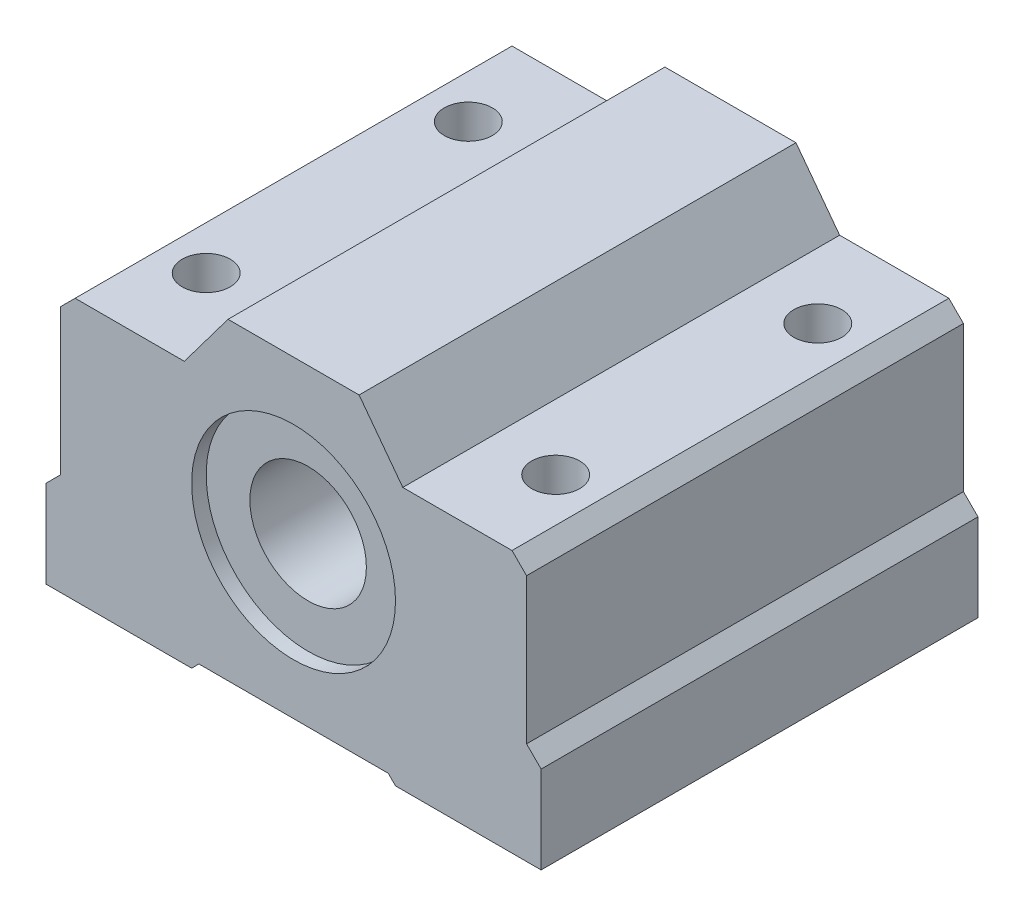
ISO-10303-21;
HEADER;
FILE_DESCRIPTION(('STEP AP214'),'2;1');
FILE_NAME('part.step','',(''),(''),'','','');
FILE_SCHEMA(('AUTOMOTIVE_DESIGN { 1 0 10303 214 1 1 1 1 }'));
ENDSEC;
DATA;
#1=APPLICATION_CONTEXT('core data for automotive mechanical design processes');
#2=APPLICATION_PROTOCOL_DEFINITION('international standard','automotive_design',2000,#1);
#3=PRODUCT_CONTEXT('',#1,'mechanical');
#4=PRODUCT('Part','Part','',(#3));
#5=PRODUCT_RELATED_PRODUCT_CATEGORY('part','',(#4));
#6=PRODUCT_DEFINITION_FORMATION('','',#4);
#7=PRODUCT_DEFINITION_CONTEXT('part definition',#1,'design');
#8=PRODUCT_DEFINITION('design','',#6,#7);
#9=PRODUCT_DEFINITION_SHAPE('','',#8);
#10=(LENGTH_UNIT() NAMED_UNIT(*) SI_UNIT(.MILLI.,.METRE.));
#11=(NAMED_UNIT(*) PLANE_ANGLE_UNIT() SI_UNIT($,.RADIAN.));
#12=(NAMED_UNIT(*) SI_UNIT($,.STERADIAN.) SOLID_ANGLE_UNIT());
#13=UNCERTAINTY_MEASURE_WITH_UNIT(LENGTH_MEASURE(1.E-05),#10,'distance_accuracy_value','');
#14=(GEOMETRIC_REPRESENTATION_CONTEXT(3) GLOBAL_UNCERTAINTY_ASSIGNED_CONTEXT((#13)) GLOBAL_UNIT_ASSIGNED_CONTEXT((#10,
#11,#12)) REPRESENTATION_CONTEXT('',''));
#15=CARTESIAN_POINT('',(0.,0.,0.));
#16=DIRECTION('',(0.,0.,1.));
#17=DIRECTION('',(1.,0.,0.));
#18=AXIS2_PLACEMENT_3D('',#15,#16,#17);
#19=CARTESIAN_POINT('',(0.,2.59475640448557,30.));
#20=DIRECTION('',(0.,0.,-1.));
#21=DIRECTION('',(-1.,0.,0.));
#22=AXIS2_PLACEMENT_3D('',#19,#20,#21);
#23=CYLINDRICAL_SURFACE('',#22,4.);
#24=CARTESIAN_POINT('',(0.,2.59475640448557,1.));
#25=DIRECTION('',(0.,0.,-1.));
#26=DIRECTION('',(-1.,0.,0.));
#27=AXIS2_PLACEMENT_3D('',#24,#25,#26);
#28=CIRCLE('',#27,4.);
#29=CARTESIAN_POINT('',(-4.,2.59475640448557,1.));
#30=VERTEX_POINT('',#29);
#31=EDGE_CURVE('E199',#30,#30,#28,.F.);
#32=ORIENTED_EDGE('',*,*,#31,.F.);
#33=EDGE_LOOP('',(#32));
#34=FACE_BOUND('',#33,.T.);
#35=CARTESIAN_POINT('',(0.,2.59475640448557,29.));
#36=DIRECTION('',(0.,0.,1.));
#37=DIRECTION('',(1.,0.,0.));
#38=AXIS2_PLACEMENT_3D('',#35,#36,#37);
#39=CIRCLE('',#38,4.);
#40=CARTESIAN_POINT('',(4.,2.59475640448557,29.));
#41=VERTEX_POINT('',#40);
#42=EDGE_CURVE('E275',#41,#41,#39,.F.);
#43=ORIENTED_EDGE('',*,*,#42,.F.);
#44=EDGE_LOOP('',(#43));
#45=FACE_BOUND('',#44,.T.);
#46=ADVANCED_FACE('F36',(#34,#45),#23,.F.);
#47=CARTESIAN_POINT('',(-16.,-1.40524359551442,30.));
#48=DIRECTION('',(1.,0.,0.));
#49=DIRECTION('',(0.,0.,-1.));
#50=AXIS2_PLACEMENT_3D('',#47,#48,#49);
#51=PLANE('',#50);
#52=DIRECTION('',(0.,-1.,0.));
#53=VECTOR('',#52,1.);
#54=CARTESIAN_POINT('',(-16.,-1.40524359551442,0.));
#55=LINE('',#54,#53);
#56=CARTESIAN_POINT('',(-16.,8.59475640448557,0.));
#57=VERTEX_POINT('',#56);
#58=CARTESIAN_POINT('',(-16.,-1.40524359551442,0.));
#59=VERTEX_POINT('',#58);
#60=EDGE_CURVE('E195',#57,#59,#55,.T.);
#61=ORIENTED_EDGE('',*,*,#60,.T.);
#62=DIRECTION('',(0.,0.,-1.));
#63=VECTOR('',#62,1.);
#64=CARTESIAN_POINT('',(-16.,-1.40524359551442,30.));
#65=LINE('',#64,#63);
#66=CARTESIAN_POINT('',(-16.,-1.40524359551442,30.));
#67=VERTEX_POINT('',#66);
#68=EDGE_CURVE('E11',#67,#59,#65,.T.);
#69=ORIENTED_EDGE('',*,*,#68,.F.);
#70=DIRECTION('',(0.,-1.,0.));
#71=VECTOR('',#70,1.);
#72=CARTESIAN_POINT('',(-16.,-1.40524359551442,30.));
#73=LINE('',#72,#71);
#74=CARTESIAN_POINT('',(-16.,8.59475640448557,30.));
#75=VERTEX_POINT('',#74);
#76=EDGE_CURVE('E230',#75,#67,#73,.T.);
#77=ORIENTED_EDGE('',*,*,#76,.F.);
#78=DIRECTION('',(0.,0.,-1.));
#79=VECTOR('',#78,1.);
#80=CARTESIAN_POINT('',(-16.,8.59475640448557,30.));
#81=LINE('',#80,#79);
#82=EDGE_CURVE('E191',#75,#57,#81,.T.);
#83=ORIENTED_EDGE('',*,*,#82,.T.);
#84=EDGE_LOOP('',(#61,#69,#77,#83));
#85=FACE_BOUND('',#84,.T.);
#86=ADVANCED_FACE('F38',(#85),#51,.F.);
#87=CARTESIAN_POINT('',(-17.,-2.40524359551442,30.));
#88=DIRECTION('',(0.707106781186547,-0.707106781186547,0.));
#89=DIRECTION('',(0.707106781186548,0.707106781186548,0.));
#90=AXIS2_PLACEMENT_3D('',#87,#88,#89);
#91=PLANE('',#90);
#92=DIRECTION('',(-0.707106781186547,-0.707106781186547,0.));
#93=VECTOR('',#92,1.);
#94=CARTESIAN_POINT('',(-17.,-2.40524359551442,0.));
#95=LINE('',#94,#93);
#96=CARTESIAN_POINT('',(-17.,-2.40524359551442,0.));
#97=VERTEX_POINT('',#96);
#98=EDGE_CURVE('E198',#59,#97,#95,.T.);
#99=ORIENTED_EDGE('',*,*,#98,.T.);
#100=DIRECTION('',(0.,0.,-1.));
#101=VECTOR('',#100,1.);
#102=CARTESIAN_POINT('',(-17.,-2.40524359551442,30.));
#103=LINE('',#102,#101);
#104=CARTESIAN_POINT('',(-17.,-2.40524359551442,30.));
#105=VERTEX_POINT('',#104);
#106=EDGE_CURVE('E46',#105,#97,#103,.T.);
#107=ORIENTED_EDGE('',*,*,#106,.F.);
#108=DIRECTION('',(-0.707106781186547,-0.707106781186547,0.));
#109=VECTOR('',#108,1.);
#110=CARTESIAN_POINT('',(-17.,-2.40524359551442,30.));
#111=LINE('',#110,#109);
#112=EDGE_CURVE('E128',#67,#105,#111,.T.);
#113=ORIENTED_EDGE('',*,*,#112,.F.);
#114=ORIENTED_EDGE('',*,*,#68,.T.);
#115=EDGE_LOOP('',(#99,#107,#113,#114));
#116=FACE_BOUND('',#115,.T.);
#117=ADVANCED_FACE('F372',(#116),#91,.F.);
#118=CARTESIAN_POINT('',(-17.,-2.40524359551442,30.));
#119=DIRECTION('',(1.,0.,0.));
#120=DIRECTION('',(0.,0.,-1.));
#121=AXIS2_PLACEMENT_3D('',#118,#119,#120);
#122=PLANE('',#121);
#123=DIRECTION('',(0.,-1.,0.));
#124=VECTOR('',#123,1.);
#125=CARTESIAN_POINT('',(-17.,-2.40524359551442,0.));
#126=LINE('',#125,#124);
#127=CARTESIAN_POINT('',(-17.,-8.40524359551443,0.));
#128=VERTEX_POINT('',#127);
#129=EDGE_CURVE('E201',#97,#128,#126,.T.);
#130=ORIENTED_EDGE('',*,*,#129,.T.);
#131=DIRECTION('',(0.,0.,-1.));
#132=VECTOR('',#131,1.);
#133=CARTESIAN_POINT('',(-17.,-8.40524359551443,30.));
#134=LINE('',#133,#132);
#135=CARTESIAN_POINT('',(-17.,-8.40524359551443,30.));
#136=VERTEX_POINT('',#135);
#137=EDGE_CURVE('E267',#136,#128,#134,.T.);
#138=ORIENTED_EDGE('',*,*,#137,.F.);
#139=DIRECTION('',(0.,-1.,0.));
#140=VECTOR('',#139,1.);
#141=CARTESIAN_POINT('',(-17.,-2.40524359551442,30.));
#142=LINE('',#141,#140);
#143=EDGE_CURVE('E315',#105,#136,#142,.T.);
#144=ORIENTED_EDGE('',*,*,#143,.F.);
#145=ORIENTED_EDGE('',*,*,#106,.T.);
#146=EDGE_LOOP('',(#130,#138,#144,#145));
#147=FACE_BOUND('',#146,.T.);
#148=ADVANCED_FACE('F480',(#147),#122,.F.);
#149=CARTESIAN_POINT('',(-17.,-8.40524359551443,30.));
#150=DIRECTION('',(0.,1.,0.));
#151=DIRECTION('',(0.,0.,1.));
#152=AXIS2_PLACEMENT_3D('',#149,#150,#151);
#153=PLANE('',#152);
#154=CARTESIAN_POINT('',(-12.,-8.40524359551443,6.));
#155=DIRECTION('',(0.,-1.,0.));
#156=DIRECTION('',(0.,0.,-1.));
#157=AXIS2_PLACEMENT_3D('',#154,#155,#156);
#158=CIRCLE('',#157,1.64999999999999);
#159=CARTESIAN_POINT('',(-12.,-8.40524359551443,4.35000000000001));
#160=VERTEX_POINT('',#159);
#161=EDGE_CURVE('E290',#160,#160,#158,.T.);
#162=ORIENTED_EDGE('',*,*,#161,.F.);
#163=EDGE_LOOP('',(#162));
#164=FACE_BOUND('',#163,.T.);
#165=CARTESIAN_POINT('',(-12.,-8.40524359551443,24.));
#166=DIRECTION('',(0.,-1.,0.));
#167=DIRECTION('',(0.,0.,-1.));
#168=AXIS2_PLACEMENT_3D('',#165,#166,#167);
#169=CIRCLE('',#168,1.64999999999999);
#170=CARTESIAN_POINT('',(-12.,-8.40524359551443,22.35));
#171=VERTEX_POINT('',#170);
#172=EDGE_CURVE('E287',#171,#171,#169,.T.);
#173=ORIENTED_EDGE('',*,*,#172,.F.);
#174=EDGE_LOOP('',(#173));
#175=FACE_BOUND('',#174,.T.);
#176=DIRECTION('',(1.,0.,0.));
#177=VECTOR('',#176,1.);
#178=CARTESIAN_POINT('',(-17.,-8.40524359551443,0.));
#179=LINE('',#178,#177);
#180=CARTESIAN_POINT('',(-7.,-8.40524359551443,0.));
#181=VERTEX_POINT('',#180);
#182=EDGE_CURVE('E203',#128,#181,#179,.T.);
#183=ORIENTED_EDGE('',*,*,#182,.T.);
#184=DIRECTION('',(0.,0.,-1.));
#185=VECTOR('',#184,1.);
#186=CARTESIAN_POINT('',(-7.,-8.40524359551443,30.));
#187=LINE('',#186,#185);
#188=CARTESIAN_POINT('',(-7.,-8.40524359551443,30.));
#189=VERTEX_POINT('',#188);
#190=EDGE_CURVE('E264',#189,#181,#187,.T.);
#191=ORIENTED_EDGE('',*,*,#190,.F.);
#192=DIRECTION('',(1.,0.,0.));
#193=VECTOR('',#192,1.);
#194=CARTESIAN_POINT('',(-17.,-8.40524359551443,30.));
#195=LINE('',#194,#193);
#196=EDGE_CURVE('E317',#136,#189,#195,.T.);
#197=ORIENTED_EDGE('',*,*,#196,.F.);
#198=ORIENTED_EDGE('',*,*,#137,.T.);
#199=EDGE_LOOP('',(#183,#191,#197,#198));
#200=FACE_BOUND('',#199,.T.);
#201=ADVANCED_FACE('F477',(#164,#175,#200),#153,.F.);
#202=CARTESIAN_POINT('',(-7.,-8.40524359551443,30.));
#203=DIRECTION('',(-0.707106781186547,0.707106781186547,0.));
#204=DIRECTION('',(-0.707106781186548,-0.707106781186548,0.));
#205=AXIS2_PLACEMENT_3D('',#202,#203,#204);
#206=PLANE('',#205);
#207=DIRECTION('',(0.707106781186547,0.707106781186547,0.));
#208=VECTOR('',#207,1.);
#209=CARTESIAN_POINT('',(-7.,-8.40524359551443,0.));
#210=LINE('',#209,#208);
#211=CARTESIAN_POINT('',(-6.5,-7.90524359551443,0.));
#212=VERTEX_POINT('',#211);
#213=EDGE_CURVE('E205',#181,#212,#210,.T.);
#214=ORIENTED_EDGE('',*,*,#213,.T.);
#215=DIRECTION('',(0.,0.,-1.));
#216=VECTOR('',#215,1.);
#217=CARTESIAN_POINT('',(-6.5,-7.90524359551443,30.));
#218=LINE('',#217,#216);
#219=CARTESIAN_POINT('',(-6.5,-7.90524359551443,30.));
#220=VERTEX_POINT('',#219);
#221=EDGE_CURVE('E261',#220,#212,#218,.T.);
#222=ORIENTED_EDGE('',*,*,#221,.F.);
#223=DIRECTION('',(0.707106781186547,0.707106781186547,0.));
#224=VECTOR('',#223,1.);
#225=CARTESIAN_POINT('',(-7.,-8.40524359551443,30.));
#226=LINE('',#225,#224);
#227=EDGE_CURVE('E319',#189,#220,#226,.T.);
#228=ORIENTED_EDGE('',*,*,#227,.F.);
#229=ORIENTED_EDGE('',*,*,#190,.T.);
#230=EDGE_LOOP('',(#214,#222,#228,#229));
#231=FACE_BOUND('',#230,.T.);
#232=ADVANCED_FACE('F473',(#231),#206,.F.);
#233=CARTESIAN_POINT('',(-6.5,-7.90524359551443,30.));
#234=DIRECTION('',(0.,1.,0.));
#235=DIRECTION('',(0.,0.,1.));
#236=AXIS2_PLACEMENT_3D('',#233,#234,#235);
#237=PLANE('',#236);
#238=DIRECTION('',(1.,0.,0.));
#239=VECTOR('',#238,1.);
#240=CARTESIAN_POINT('',(-6.5,-7.90524359551443,0.));
#241=LINE('',#240,#239);
#242=CARTESIAN_POINT('',(6.5,-7.90524359551443,0.));
#243=VERTEX_POINT('',#242);
#244=EDGE_CURVE('E207',#212,#243,#241,.T.);
#245=ORIENTED_EDGE('',*,*,#244,.T.);
#246=DIRECTION('',(0.,0.,-1.));
#247=VECTOR('',#246,1.);
#248=CARTESIAN_POINT('',(6.5,-7.90524359551443,30.));
#249=LINE('',#248,#247);
#250=CARTESIAN_POINT('',(6.5,-7.90524359551443,30.));
#251=VERTEX_POINT('',#250);
#252=EDGE_CURVE('E258',#251,#243,#249,.T.);
#253=ORIENTED_EDGE('',*,*,#252,.F.);
#254=DIRECTION('',(1.,0.,0.));
#255=VECTOR('',#254,1.);
#256=CARTESIAN_POINT('',(-6.5,-7.90524359551443,30.));
#257=LINE('',#256,#255);
#258=EDGE_CURVE('E321',#220,#251,#257,.T.);
#259=ORIENTED_EDGE('',*,*,#258,.F.);
#260=ORIENTED_EDGE('',*,*,#221,.T.);
#261=EDGE_LOOP('',(#245,#253,#259,#260));
#262=FACE_BOUND('',#261,.T.);
#263=ADVANCED_FACE('F468',(#262),#237,.F.);
#264=CARTESIAN_POINT('',(6.5,-7.90524359551443,30.));
#265=DIRECTION('',(0.707106781186547,0.707106781186547,0.));
#266=DIRECTION('',(-0.707106781186548,0.707106781186548,0.));
#267=AXIS2_PLACEMENT_3D('',#264,#265,#266);
#268=PLANE('',#267);
#269=DIRECTION('',(0.707106781186547,-0.707106781186547,0.));
#270=VECTOR('',#269,1.);
#271=CARTESIAN_POINT('',(6.5,-7.90524359551443,0.));
#272=LINE('',#271,#270);
#273=CARTESIAN_POINT('',(7.,-8.40524359551443,0.));
#274=VERTEX_POINT('',#273);
#275=EDGE_CURVE('E209',#243,#274,#272,.T.);
#276=ORIENTED_EDGE('',*,*,#275,.T.);
#277=DIRECTION('',(0.,0.,-1.));
#278=VECTOR('',#277,1.);
#279=CARTESIAN_POINT('',(7.,-8.40524359551443,30.));
#280=LINE('',#279,#278);
#281=CARTESIAN_POINT('',(7.,-8.40524359551443,30.));
#282=VERTEX_POINT('',#281);
#283=EDGE_CURVE('E255',#282,#274,#280,.T.);
#284=ORIENTED_EDGE('',*,*,#283,.F.);
#285=DIRECTION('',(0.707106781186547,-0.707106781186547,0.));
#286=VECTOR('',#285,1.);
#287=CARTESIAN_POINT('',(6.5,-7.90524359551443,30.));
#288=LINE('',#287,#286);
#289=EDGE_CURVE('E323',#251,#282,#288,.T.);
#290=ORIENTED_EDGE('',*,*,#289,.F.);
#291=ORIENTED_EDGE('',*,*,#252,.T.);
#292=EDGE_LOOP('',(#276,#284,#290,#291));
#293=FACE_BOUND('',#292,.T.);
#294=ADVANCED_FACE('F462',(#293),#268,.F.);
#295=CARTESIAN_POINT('',(7.,-8.40524359551443,30.));
#296=DIRECTION('',(0.,1.,0.));
#297=DIRECTION('',(0.,0.,1.));
#298=AXIS2_PLACEMENT_3D('',#295,#296,#297);
#299=PLANE('',#298);
#300=CARTESIAN_POINT('',(12.,-8.40524359551443,6.));
#301=DIRECTION('',(0.,-1.,0.));
#302=DIRECTION('',(0.,0.,-1.));
#303=AXIS2_PLACEMENT_3D('',#300,#301,#302);
#304=CIRCLE('',#303,1.64999999999999);
#305=CARTESIAN_POINT('',(12.,-8.40524359551443,4.35000000000001));
#306=VERTEX_POINT('',#305);
#307=EDGE_CURVE('E300',#306,#306,#304,.T.);
#308=ORIENTED_EDGE('',*,*,#307,.F.);
#309=EDGE_LOOP('',(#308));
#310=FACE_BOUND('',#309,.T.);
#311=CARTESIAN_POINT('',(12.,-8.40524359551443,24.));
#312=DIRECTION('',(0.,-1.,0.));
#313=DIRECTION('',(0.,0.,-1.));
#314=AXIS2_PLACEMENT_3D('',#311,#312,#313);
#315=CIRCLE('',#314,1.64999999999999);
#316=CARTESIAN_POINT('',(12.,-8.40524359551443,22.35));
#317=VERTEX_POINT('',#316);
#318=EDGE_CURVE('E284',#317,#317,#315,.T.);
#319=ORIENTED_EDGE('',*,*,#318,.F.);
#320=EDGE_LOOP('',(#319));
#321=FACE_BOUND('',#320,.T.);
#322=DIRECTION('',(1.,0.,0.));
#323=VECTOR('',#322,1.);
#324=CARTESIAN_POINT('',(7.,-8.40524359551443,0.));
#325=LINE('',#324,#323);
#326=CARTESIAN_POINT('',(17.,-8.40524359551443,0.));
#327=VERTEX_POINT('',#326);
#328=EDGE_CURVE('E211',#274,#327,#325,.T.);
#329=ORIENTED_EDGE('',*,*,#328,.T.);
#330=DIRECTION('',(0.,0.,-1.));
#331=VECTOR('',#330,1.);
#332=CARTESIAN_POINT('',(17.,-8.40524359551443,30.));
#333=LINE('',#332,#331);
#334=CARTESIAN_POINT('',(17.,-8.40524359551443,30.));
#335=VERTEX_POINT('',#334);
#336=EDGE_CURVE('E252',#335,#327,#333,.T.);
#337=ORIENTED_EDGE('',*,*,#336,.F.);
#338=DIRECTION('',(1.,0.,0.));
#339=VECTOR('',#338,1.);
#340=CARTESIAN_POINT('',(7.,-8.40524359551443,30.));
#341=LINE('',#340,#339);
#342=EDGE_CURVE('E325',#282,#335,#341,.T.);
#343=ORIENTED_EDGE('',*,*,#342,.F.);
#344=ORIENTED_EDGE('',*,*,#283,.T.);
#345=EDGE_LOOP('',(#329,#337,#343,#344));
#346=FACE_BOUND('',#345,.T.);
#347=ADVANCED_FACE('F458',(#310,#321,#346),#299,.F.);
#348=CARTESIAN_POINT('',(17.,-8.40524359551443,30.));
#349=DIRECTION('',(-1.,0.,0.));
#350=DIRECTION('',(0.,0.,1.));
#351=AXIS2_PLACEMENT_3D('',#348,#349,#350);
#352=PLANE('',#351);
#353=DIRECTION('',(0.,1.,0.));
#354=VECTOR('',#353,1.);
#355=CARTESIAN_POINT('',(17.,-8.40524359551443,0.));
#356=LINE('',#355,#354);
#357=CARTESIAN_POINT('',(17.,-2.40524359551442,0.));
#358=VERTEX_POINT('',#357);
#359=EDGE_CURVE('E213',#327,#358,#356,.T.);
#360=ORIENTED_EDGE('',*,*,#359,.T.);
#361=DIRECTION('',(0.,0.,-1.));
#362=VECTOR('',#361,1.);
#363=CARTESIAN_POINT('',(17.,-2.40524359551442,30.));
#364=LINE('',#363,#362);
#365=CARTESIAN_POINT('',(17.,-2.40524359551442,30.));
#366=VERTEX_POINT('',#365);
#367=EDGE_CURVE('E249',#366,#358,#364,.T.);
#368=ORIENTED_EDGE('',*,*,#367,.F.);
#369=DIRECTION('',(0.,1.,0.));
#370=VECTOR('',#369,1.);
#371=CARTESIAN_POINT('',(17.,-8.40524359551443,30.));
#372=LINE('',#371,#370);
#373=EDGE_CURVE('E327',#335,#366,#372,.T.);
#374=ORIENTED_EDGE('',*,*,#373,.F.);
#375=ORIENTED_EDGE('',*,*,#336,.T.);
#376=EDGE_LOOP('',(#360,#368,#374,#375));
#377=FACE_BOUND('',#376,.T.);
#378=ADVANCED_FACE('F453',(#377),#352,.F.);
#379=CARTESIAN_POINT('',(16.,-1.40524359551442,30.));
#380=DIRECTION('',(-0.707106781186547,-0.707106781186547,0.));
#381=DIRECTION('',(0.707106781186548,-0.707106781186548,0.));
#382=AXIS2_PLACEMENT_3D('',#379,#380,#381);
#383=PLANE('',#382);
#384=DIRECTION('',(-0.707106781186547,0.707106781186547,0.));
#385=VECTOR('',#384,1.);
#386=CARTESIAN_POINT('',(16.,-1.40524359551442,0.));
#387=LINE('',#386,#385);
#388=CARTESIAN_POINT('',(16.,-1.40524359551442,0.));
#389=VERTEX_POINT('',#388);
#390=EDGE_CURVE('E215',#358,#389,#387,.T.);
#391=ORIENTED_EDGE('',*,*,#390,.T.);
#392=DIRECTION('',(0.,0.,-1.));
#393=VECTOR('',#392,1.);
#394=CARTESIAN_POINT('',(16.,-1.40524359551442,30.));
#395=LINE('',#394,#393);
#396=CARTESIAN_POINT('',(16.,-1.40524359551442,30.));
#397=VERTEX_POINT('',#396);
#398=EDGE_CURVE('E246',#397,#389,#395,.T.);
#399=ORIENTED_EDGE('',*,*,#398,.F.);
#400=DIRECTION('',(-0.707106781186547,0.707106781186547,0.));
#401=VECTOR('',#400,1.);
#402=CARTESIAN_POINT('',(16.,-1.40524359551442,30.));
#403=LINE('',#402,#401);
#404=EDGE_CURVE('E329',#366,#397,#403,.T.);
#405=ORIENTED_EDGE('',*,*,#404,.F.);
#406=ORIENTED_EDGE('',*,*,#367,.T.);
#407=EDGE_LOOP('',(#391,#399,#405,#406));
#408=FACE_BOUND('',#407,.T.);
#409=ADVANCED_FACE('F447',(#408),#383,.F.);
#410=CARTESIAN_POINT('',(16.,8.59475640448557,30.));
#411=DIRECTION('',(-1.,0.,0.));
#412=DIRECTION('',(0.,0.,1.));
#413=AXIS2_PLACEMENT_3D('',#410,#411,#412);
#414=PLANE('',#413);
#415=DIRECTION('',(0.,1.,0.));
#416=VECTOR('',#415,1.);
#417=CARTESIAN_POINT('',(16.,8.59475640448557,0.));
#418=LINE('',#417,#416);
#419=CARTESIAN_POINT('',(16.,8.59475640448557,0.));
#420=VERTEX_POINT('',#419);
#421=EDGE_CURVE('E217',#389,#420,#418,.T.);
#422=ORIENTED_EDGE('',*,*,#421,.T.);
#423=DIRECTION('',(0.,0.,-1.));
#424=VECTOR('',#423,1.);
#425=CARTESIAN_POINT('',(16.,8.59475640448557,30.));
#426=LINE('',#425,#424);
#427=CARTESIAN_POINT('',(16.,8.59475640448557,30.));
#428=VERTEX_POINT('',#427);
#429=EDGE_CURVE('E243',#428,#420,#426,.T.);
#430=ORIENTED_EDGE('',*,*,#429,.F.);
#431=DIRECTION('',(0.,1.,0.));
#432=VECTOR('',#431,1.);
#433=CARTESIAN_POINT('',(16.,8.59475640448557,30.));
#434=LINE('',#433,#432);
#435=EDGE_CURVE('E331',#397,#428,#434,.T.);
#436=ORIENTED_EDGE('',*,*,#435,.F.);
#437=ORIENTED_EDGE('',*,*,#398,.T.);
#438=EDGE_LOOP('',(#422,#430,#436,#437));
#439=FACE_BOUND('',#438,.T.);
#440=ADVANCED_FACE('F443',(#439),#414,.F.);
#441=CARTESIAN_POINT('',(15.,9.59475640448557,30.));
#442=DIRECTION('',(-0.707106781186547,-0.707106781186548,0.));
#443=DIRECTION('',(0.707106781186548,-0.707106781186547,0.));
#444=AXIS2_PLACEMENT_3D('',#441,#442,#443);
#445=PLANE('',#444);
#446=DIRECTION('',(-0.707106781186548,0.707106781186547,0.));
#447=VECTOR('',#446,1.);
#448=CARTESIAN_POINT('',(15.,9.59475640448557,0.));
#449=LINE('',#448,#447);
#450=CARTESIAN_POINT('',(15.,9.59475640448557,0.));
#451=VERTEX_POINT('',#450);
#452=EDGE_CURVE('E219',#420,#451,#449,.T.);
#453=ORIENTED_EDGE('',*,*,#452,.T.);
#454=DIRECTION('',(0.,0.,-1.));
#455=VECTOR('',#454,1.);
#456=CARTESIAN_POINT('',(15.,9.59475640448557,30.));
#457=LINE('',#456,#455);
#458=CARTESIAN_POINT('',(15.,9.59475640448557,30.));
#459=VERTEX_POINT('',#458);
#460=EDGE_CURVE('E240',#459,#451,#457,.T.);
#461=ORIENTED_EDGE('',*,*,#460,.F.);
#462=DIRECTION('',(-0.707106781186548,0.707106781186547,0.));
#463=VECTOR('',#462,1.);
#464=CARTESIAN_POINT('',(15.,9.59475640448557,30.));
#465=LINE('',#464,#463);
#466=EDGE_CURVE('E333',#428,#459,#465,.T.);
#467=ORIENTED_EDGE('',*,*,#466,.F.);
#468=ORIENTED_EDGE('',*,*,#429,.T.);
#469=EDGE_LOOP('',(#453,#461,#467,#468));
#470=FACE_BOUND('',#469,.T.);
#471=ADVANCED_FACE('F429',(#470),#445,.F.);
#472=CARTESIAN_POINT('',(7.5,9.59475640448557,30.));
#473=DIRECTION('',(0.,-1.,0.));
#474=DIRECTION('',(0.,0.,-1.));
#475=AXIS2_PLACEMENT_3D('',#472,#473,#474);
#476=PLANE('',#475);
#477=CARTESIAN_POINT('',(12.,9.59475640448557,6.));
#478=DIRECTION('',(0.,-1.,0.));
#479=DIRECTION('',(0.,0.,-1.));
#480=AXIS2_PLACEMENT_3D('',#477,#478,#479);
#481=CIRCLE('',#480,1.64999999999999);
#482=CARTESIAN_POINT('',(12.,9.59475640448557,4.35000000000001));
#483=VERTEX_POINT('',#482);
#484=EDGE_CURVE('E40',#483,#483,#481,.T.);
#485=ORIENTED_EDGE('',*,*,#484,.T.);
#486=EDGE_LOOP('',(#485));
#487=FACE_BOUND('',#486,.T.);
#488=CARTESIAN_POINT('',(12.,9.59475640448557,24.));
#489=DIRECTION('',(0.,-1.,0.));
#490=DIRECTION('',(0.,0.,-1.));
#491=AXIS2_PLACEMENT_3D('',#488,#489,#490);
#492=CIRCLE('',#491,1.64999999999999);
#493=CARTESIAN_POINT('',(12.,9.59475640448557,22.35));
#494=VERTEX_POINT('',#493);
#495=EDGE_CURVE('E280',#494,#494,#492,.T.);
#496=ORIENTED_EDGE('',*,*,#495,.T.);
#497=EDGE_LOOP('',(#496));
#498=FACE_BOUND('',#497,.T.);
#499=DIRECTION('',(-1.,0.,0.));
#500=VECTOR('',#499,1.);
#501=CARTESIAN_POINT('',(7.5,9.59475640448557,0.));
#502=LINE('',#501,#500);
#503=CARTESIAN_POINT('',(7.5,9.59475640448557,0.));
#504=VERTEX_POINT('',#503);
#505=EDGE_CURVE('E221',#451,#504,#502,.T.);
#506=ORIENTED_EDGE('',*,*,#505,.T.);
#507=DIRECTION('',(0.,0.,-1.));
#508=VECTOR('',#507,1.);
#509=CARTESIAN_POINT('',(7.5,9.59475640448557,30.));
#510=LINE('',#509,#508);
#511=CARTESIAN_POINT('',(7.5,9.59475640448557,30.));
#512=VERTEX_POINT('',#511);
#513=EDGE_CURVE('E237',#512,#504,#510,.T.);
#514=ORIENTED_EDGE('',*,*,#513,.F.);
#515=DIRECTION('',(-1.,0.,0.));
#516=VECTOR('',#515,1.);
#517=CARTESIAN_POINT('',(7.5,9.59475640448557,30.));
#518=LINE('',#517,#516);
#519=EDGE_CURVE('E335',#459,#512,#518,.T.);
#520=ORIENTED_EDGE('',*,*,#519,.F.);
#521=ORIENTED_EDGE('',*,*,#460,.T.);
#522=EDGE_LOOP('',(#506,#514,#520,#521));
#523=FACE_BOUND('',#522,.T.);
#524=ADVANCED_FACE('F426',(#487,#498,#523),#476,.F.);
#525=CARTESIAN_POINT('',(4.5,13.5947564044856,30.));
#526=DIRECTION('',(-0.8,-0.6,0.));
#527=DIRECTION('',(0.6,-0.8,0.));
#528=AXIS2_PLACEMENT_3D('',#525,#526,#527);
#529=PLANE('',#528);
#530=DIRECTION('',(-0.6,0.8,0.));
#531=VECTOR('',#530,1.);
#532=CARTESIAN_POINT('',(4.5,13.5947564044856,0.));
#533=LINE('',#532,#531);
#534=CARTESIAN_POINT('',(4.5,13.5947564044856,0.));
#535=VERTEX_POINT('',#534);
#536=EDGE_CURVE('E223',#504,#535,#533,.T.);
#537=ORIENTED_EDGE('',*,*,#536,.T.);
#538=DIRECTION('',(0.,0.,-1.));
#539=VECTOR('',#538,1.);
#540=CARTESIAN_POINT('',(4.5,13.5947564044856,30.));
#541=LINE('',#540,#539);
#542=CARTESIAN_POINT('',(4.5,13.5947564044856,30.));
#543=VERTEX_POINT('',#542);
#544=EDGE_CURVE('E234',#543,#535,#541,.T.);
#545=ORIENTED_EDGE('',*,*,#544,.F.);
#546=DIRECTION('',(-0.6,0.8,0.));
#547=VECTOR('',#546,1.);
#548=CARTESIAN_POINT('',(4.5,13.5947564044856,30.));
#549=LINE('',#548,#547);
#550=EDGE_CURVE('E337',#512,#543,#549,.T.);
#551=ORIENTED_EDGE('',*,*,#550,.F.);
#552=ORIENTED_EDGE('',*,*,#513,.T.);
#553=EDGE_LOOP('',(#537,#545,#551,#552));
#554=FACE_BOUND('',#553,.T.);
#555=ADVANCED_FACE('F343',(#554),#529,.F.);
#556=CARTESIAN_POINT('',(-4.5,13.5947564044856,30.));
#557=DIRECTION('',(0.,-1.,0.));
#558=DIRECTION('',(0.,0.,-1.));
#559=AXIS2_PLACEMENT_3D('',#556,#557,#558);
#560=PLANE('',#559);
#561=DIRECTION('',(-1.,0.,0.));
#562=VECTOR('',#561,1.);
#563=CARTESIAN_POINT('',(-4.5,13.5947564044856,0.));
#564=LINE('',#563,#562);
#565=CARTESIAN_POINT('',(-4.5,13.5947564044856,0.));
#566=VERTEX_POINT('',#565);
#567=EDGE_CURVE('E225',#535,#566,#564,.T.);
#568=ORIENTED_EDGE('',*,*,#567,.T.);
#569=DIRECTION('',(0.,0.,-1.));
#570=VECTOR('',#569,1.);
#571=CARTESIAN_POINT('',(-4.5,13.5947564044856,30.));
#572=LINE('',#571,#570);
#573=CARTESIAN_POINT('',(-4.5,13.5947564044856,30.));
#574=VERTEX_POINT('',#573);
#575=EDGE_CURVE('E186',#574,#566,#572,.T.);
#576=ORIENTED_EDGE('',*,*,#575,.F.);
#577=DIRECTION('',(-1.,0.,0.));
#578=VECTOR('',#577,1.);
#579=CARTESIAN_POINT('',(-4.5,13.5947564044856,30.));
#580=LINE('',#579,#578);
#581=EDGE_CURVE('E177',#543,#574,#580,.T.);
#582=ORIENTED_EDGE('',*,*,#581,.F.);
#583=ORIENTED_EDGE('',*,*,#544,.T.);
#584=EDGE_LOOP('',(#568,#576,#582,#583));
#585=FACE_BOUND('',#584,.T.);
#586=ADVANCED_FACE('F347',(#585),#560,.F.);
#587=CARTESIAN_POINT('',(-7.5,9.59475640448557,30.));
#588=DIRECTION('',(0.8,-0.6,0.));
#589=DIRECTION('',(0.6,0.8,0.));
#590=AXIS2_PLACEMENT_3D('',#587,#588,#589);
#591=PLANE('',#590);
#592=DIRECTION('',(-0.6,-0.8,0.));
#593=VECTOR('',#592,1.);
#594=CARTESIAN_POINT('',(-7.5,9.59475640448557,0.));
#595=LINE('',#594,#593);
#596=CARTESIAN_POINT('',(-7.5,9.59475640448557,0.));
#597=VERTEX_POINT('',#596);
#598=EDGE_CURVE('E185',#566,#597,#595,.T.);
#599=ORIENTED_EDGE('',*,*,#598,.T.);
#600=DIRECTION('',(0.,0.,-1.));
#601=VECTOR('',#600,1.);
#602=CARTESIAN_POINT('',(-7.5,9.59475640448557,30.));
#603=LINE('',#602,#601);
#604=CARTESIAN_POINT('',(-7.5,9.59475640448557,30.));
#605=VERTEX_POINT('',#604);
#606=EDGE_CURVE('E182',#605,#597,#603,.T.);
#607=ORIENTED_EDGE('',*,*,#606,.F.);
#608=DIRECTION('',(-0.6,-0.8,0.));
#609=VECTOR('',#608,1.);
#610=CARTESIAN_POINT('',(-7.5,9.59475640448557,30.));
#611=LINE('',#610,#609);
#612=EDGE_CURVE('E171',#574,#605,#611,.T.);
#613=ORIENTED_EDGE('',*,*,#612,.F.);
#614=ORIENTED_EDGE('',*,*,#575,.T.);
#615=EDGE_LOOP('',(#599,#607,#613,#614));
#616=FACE_BOUND('',#615,.T.);
#617=ADVANCED_FACE('F183',(#616),#591,.F.);
#618=CARTESIAN_POINT('',(-15.,9.59475640448557,30.));
#619=DIRECTION('',(0.,-1.,0.));
#620=DIRECTION('',(0.,0.,-1.));
#621=AXIS2_PLACEMENT_3D('',#618,#619,#620);
#622=PLANE('',#621);
#623=CARTESIAN_POINT('',(-12.,9.59475640448557,6.));
#624=DIRECTION('',(0.,-1.,0.));
#625=DIRECTION('',(0.,0.,-1.));
#626=AXIS2_PLACEMENT_3D('',#623,#624,#625);
#627=CIRCLE('',#626,1.64999999999999);
#628=CARTESIAN_POINT('',(-12.,9.59475640448557,4.35000000000001));
#629=VERTEX_POINT('',#628);
#630=EDGE_CURVE('E288',#629,#629,#627,.T.);
#631=ORIENTED_EDGE('',*,*,#630,.T.);
#632=EDGE_LOOP('',(#631));
#633=FACE_BOUND('',#632,.T.);
#634=CARTESIAN_POINT('',(-12.,9.59475640448557,24.));
#635=DIRECTION('',(0.,-1.,0.));
#636=DIRECTION('',(0.,0.,-1.));
#637=AXIS2_PLACEMENT_3D('',#634,#635,#636);
#638=CIRCLE('',#637,1.64999999999999);
#639=CARTESIAN_POINT('',(-12.,9.59475640448557,22.35));
#640=VERTEX_POINT('',#639);
#641=EDGE_CURVE('E285',#640,#640,#638,.T.);
#642=ORIENTED_EDGE('',*,*,#641,.T.);
#643=EDGE_LOOP('',(#642));
#644=FACE_BOUND('',#643,.T.);
#645=DIRECTION('',(-1.,0.,0.));
#646=VECTOR('',#645,1.);
#647=CARTESIAN_POINT('',(-15.,9.59475640448557,0.));
#648=LINE('',#647,#646);
#649=CARTESIAN_POINT('',(-15.,9.59475640448557,0.));
#650=VERTEX_POINT('',#649);
#651=EDGE_CURVE('E114',#597,#650,#648,.T.);
#652=ORIENTED_EDGE('',*,*,#651,.T.);
#653=DIRECTION('',(0.,0.,-1.));
#654=VECTOR('',#653,1.);
#655=CARTESIAN_POINT('',(-15.,9.59475640448557,30.));
#656=LINE('',#655,#654);
#657=CARTESIAN_POINT('',(-15.,9.59475640448557,30.));
#658=VERTEX_POINT('',#657);
#659=EDGE_CURVE('E187',#658,#650,#656,.T.);
#660=ORIENTED_EDGE('',*,*,#659,.F.);
#661=DIRECTION('',(-1.,0.,0.));
#662=VECTOR('',#661,1.);
#663=CARTESIAN_POINT('',(-15.,9.59475640448557,30.));
#664=LINE('',#663,#662);
#665=EDGE_CURVE('E175',#605,#658,#664,.T.);
#666=ORIENTED_EDGE('',*,*,#665,.F.);
#667=ORIENTED_EDGE('',*,*,#606,.T.);
#668=EDGE_LOOP('',(#652,#660,#666,#667));
#669=FACE_BOUND('',#668,.T.);
#670=ADVANCED_FACE('F189',(#633,#644,#669),#622,.F.);
#671=CARTESIAN_POINT('',(-16.,8.59475640448557,30.));
#672=DIRECTION('',(0.707106781186547,-0.707106781186547,0.));
#673=DIRECTION('',(0.707106781186548,0.707106781186548,0.));
#674=AXIS2_PLACEMENT_3D('',#671,#672,#673);
#675=PLANE('',#674);
#676=DIRECTION('',(-0.707106781186547,-0.707106781186547,0.));
#677=VECTOR('',#676,1.);
#678=CARTESIAN_POINT('',(-16.,8.59475640448557,0.));
#679=LINE('',#678,#677);
#680=EDGE_CURVE('E120',#650,#57,#679,.T.);
#681=ORIENTED_EDGE('',*,*,#680,.T.);
#682=ORIENTED_EDGE('',*,*,#82,.F.);
#683=DIRECTION('',(-0.707106781186547,-0.707106781186547,0.));
#684=VECTOR('',#683,1.);
#685=CARTESIAN_POINT('',(-16.,8.59475640448557,30.));
#686=LINE('',#685,#684);
#687=EDGE_CURVE('E55',#658,#75,#686,.T.);
#688=ORIENTED_EDGE('',*,*,#687,.F.);
#689=ORIENTED_EDGE('',*,*,#659,.T.);
#690=EDGE_LOOP('',(#681,#682,#688,#689));
#691=FACE_BOUND('',#690,.T.);
#692=ADVANCED_FACE('F355',(#691),#675,.F.);
#693=CARTESIAN_POINT('',(0.,0.,30.));
#694=DIRECTION('',(0.,0.,-1.));
#695=DIRECTION('',(-1.,0.,0.));
#696=AXIS2_PLACEMENT_3D('',#693,#694,#695);
#697=PLANE('',#696);
#698=CARTESIAN_POINT('',(0.,2.59475640448557,30.));
#699=DIRECTION('',(0.,0.,1.));
#700=DIRECTION('',(1.,0.,0.));
#701=AXIS2_PLACEMENT_3D('',#698,#699,#700);
#702=CIRCLE('',#701,7.);
#703=CARTESIAN_POINT('',(7.,2.59475640448557,30.));
#704=VERTEX_POINT('',#703);
#705=EDGE_CURVE('E283',#704,#704,#702,.T.);
#706=ORIENTED_EDGE('',*,*,#705,.F.);
#707=EDGE_LOOP('',(#706));
#708=FACE_BOUND('',#707,.T.);
#709=ORIENTED_EDGE('',*,*,#76,.T.);
#710=ORIENTED_EDGE('',*,*,#112,.T.);
#711=ORIENTED_EDGE('',*,*,#143,.T.);
#712=ORIENTED_EDGE('',*,*,#196,.T.);
#713=ORIENTED_EDGE('',*,*,#227,.T.);
#714=ORIENTED_EDGE('',*,*,#258,.T.);
#715=ORIENTED_EDGE('',*,*,#289,.T.);
#716=ORIENTED_EDGE('',*,*,#342,.T.);
#717=ORIENTED_EDGE('',*,*,#373,.T.);
#718=ORIENTED_EDGE('',*,*,#404,.T.);
#719=ORIENTED_EDGE('',*,*,#435,.T.);
#720=ORIENTED_EDGE('',*,*,#466,.T.);
#721=ORIENTED_EDGE('',*,*,#519,.T.);
#722=ORIENTED_EDGE('',*,*,#550,.T.);
#723=ORIENTED_EDGE('',*,*,#581,.T.);
#724=ORIENTED_EDGE('',*,*,#612,.T.);
#725=ORIENTED_EDGE('',*,*,#665,.T.);
#726=ORIENTED_EDGE('',*,*,#687,.T.);
#727=EDGE_LOOP('',(#709,#710,#711,#712,#713,#714,#715,#716,#717,#718,#719,#720,#721,#722,#723,
#724,#725,#726));
#728=FACE_BOUND('',#727,.T.);
#729=ADVANCED_FACE('F173',(#708,#728),#697,.F.);
#730=CARTESIAN_POINT('',(0.,0.,0.));
#731=DIRECTION('',(0.,0.,-1.));
#732=DIRECTION('',(-1.,0.,0.));
#733=AXIS2_PLACEMENT_3D('',#730,#731,#732);
#734=PLANE('',#733);
#735=CARTESIAN_POINT('',(0.,2.59475640448557,0.));
#736=DIRECTION('',(0.,0.,-1.));
#737=DIRECTION('',(-1.,0.,0.));
#738=AXIS2_PLACEMENT_3D('',#735,#736,#737);
#739=CIRCLE('',#738,7.);
#740=CARTESIAN_POINT('',(-7.,2.59475640448557,0.));
#741=VERTEX_POINT('',#740);
#742=EDGE_CURVE('E278',#741,#741,#739,.T.);
#743=ORIENTED_EDGE('',*,*,#742,.F.);
#744=EDGE_LOOP('',(#743));
#745=FACE_BOUND('',#744,.T.);
#746=ORIENTED_EDGE('',*,*,#60,.F.);
#747=ORIENTED_EDGE('',*,*,#680,.F.);
#748=ORIENTED_EDGE('',*,*,#651,.F.);
#749=ORIENTED_EDGE('',*,*,#598,.F.);
#750=ORIENTED_EDGE('',*,*,#567,.F.);
#751=ORIENTED_EDGE('',*,*,#536,.F.);
#752=ORIENTED_EDGE('',*,*,#505,.F.);
#753=ORIENTED_EDGE('',*,*,#452,.F.);
#754=ORIENTED_EDGE('',*,*,#421,.F.);
#755=ORIENTED_EDGE('',*,*,#390,.F.);
#756=ORIENTED_EDGE('',*,*,#359,.F.);
#757=ORIENTED_EDGE('',*,*,#328,.F.);
#758=ORIENTED_EDGE('',*,*,#275,.F.);
#759=ORIENTED_EDGE('',*,*,#244,.F.);
#760=ORIENTED_EDGE('',*,*,#213,.F.);
#761=ORIENTED_EDGE('',*,*,#182,.F.);
#762=ORIENTED_EDGE('',*,*,#129,.F.);
#763=ORIENTED_EDGE('',*,*,#98,.F.);
#764=EDGE_LOOP('',(#746,#747,#748,#749,#750,#751,#752,#753,#754,#755,#756,#757,#758,#759,#760,
#761,#762,#763));
#765=FACE_BOUND('',#764,.T.);
#766=ADVANCED_FACE('F350',(#745,#765),#734,.T.);
#767=CARTESIAN_POINT('',(0.,2.59475640448557,1.));
#768=DIRECTION('',(0.,0.,-1.));
#769=DIRECTION('',(-1.,0.,0.));
#770=AXIS2_PLACEMENT_3D('',#767,#768,#769);
#771=PLANE('',#770);
#772=CARTESIAN_POINT('',(0.,2.59475640448557,1.));
#773=DIRECTION('',(0.,0.,-1.));
#774=DIRECTION('',(-1.,0.,0.));
#775=AXIS2_PLACEMENT_3D('',#772,#773,#774);
#776=CIRCLE('',#775,7.);
#777=CARTESIAN_POINT('',(-7.,2.59475640448557,1.));
#778=VERTEX_POINT('',#777);
#779=EDGE_CURVE('E274',#778,#778,#776,.T.);
#780=ORIENTED_EDGE('',*,*,#779,.T.);
#781=EDGE_LOOP('',(#780));
#782=FACE_BOUND('',#781,.T.);
#783=ORIENTED_EDGE('',*,*,#31,.T.);
#784=EDGE_LOOP('',(#783));
#785=FACE_BOUND('',#784,.T.);
#786=ADVANCED_FACE('F379',(#782,#785),#771,.T.);
#787=CARTESIAN_POINT('',(0.,2.59475640448557,1.));
#788=DIRECTION('',(0.,0.,-1.));
#789=DIRECTION('',(-1.,0.,0.));
#790=AXIS2_PLACEMENT_3D('',#787,#788,#789);
#791=CYLINDRICAL_SURFACE('',#790,7.);
#792=ORIENTED_EDGE('',*,*,#779,.F.);
#793=EDGE_LOOP('',(#792));
#794=FACE_BOUND('',#793,.T.);
#795=ORIENTED_EDGE('',*,*,#742,.T.);
#796=EDGE_LOOP('',(#795));
#797=FACE_BOUND('',#796,.T.);
#798=ADVANCED_FACE('F376',(#794,#797),#791,.F.);
#799=CARTESIAN_POINT('',(0.,2.59475640448557,29.));
#800=DIRECTION('',(0.,0.,1.));
#801=DIRECTION('',(1.,0.,0.));
#802=AXIS2_PLACEMENT_3D('',#799,#800,#801);
#803=PLANE('',#802);
#804=CARTESIAN_POINT('',(0.,2.59475640448557,29.));
#805=DIRECTION('',(0.,0.,1.));
#806=DIRECTION('',(1.,0.,0.));
#807=AXIS2_PLACEMENT_3D('',#804,#805,#806);
#808=CIRCLE('',#807,7.);
#809=CARTESIAN_POINT('',(7.,2.59475640448557,29.));
#810=VERTEX_POINT('',#809);
#811=EDGE_CURVE('E279',#810,#810,#808,.T.);
#812=ORIENTED_EDGE('',*,*,#811,.T.);
#813=EDGE_LOOP('',(#812));
#814=FACE_BOUND('',#813,.T.);
#815=ORIENTED_EDGE('',*,*,#42,.T.);
#816=EDGE_LOOP('',(#815));
#817=FACE_BOUND('',#816,.T.);
#818=ADVANCED_FACE('F388',(#814,#817),#803,.T.);
#819=CARTESIAN_POINT('',(0.,2.59475640448557,29.));
#820=DIRECTION('',(0.,0.,1.));
#821=DIRECTION('',(1.,0.,0.));
#822=AXIS2_PLACEMENT_3D('',#819,#820,#821);
#823=CYLINDRICAL_SURFACE('',#822,7.);
#824=ORIENTED_EDGE('',*,*,#811,.F.);
#825=EDGE_LOOP('',(#824));
#826=FACE_BOUND('',#825,.T.);
#827=ORIENTED_EDGE('',*,*,#705,.T.);
#828=EDGE_LOOP('',(#827));
#829=FACE_BOUND('',#828,.T.);
#830=ADVANCED_FACE('F393',(#826,#829),#823,.F.);
#831=CARTESIAN_POINT('',(12.,-8.40524359551443,24.));
#832=DIRECTION('',(0.,-1.,0.));
#833=DIRECTION('',(0.,0.,-1.));
#834=AXIS2_PLACEMENT_3D('',#831,#832,#833);
#835=CYLINDRICAL_SURFACE('',#834,1.64999999999999);
#836=ORIENTED_EDGE('',*,*,#318,.T.);
#837=EDGE_LOOP('',(#836));
#838=FACE_BOUND('',#837,.T.);
#839=ORIENTED_EDGE('',*,*,#495,.F.);
#840=EDGE_LOOP('',(#839));
#841=FACE_BOUND('',#840,.T.);
#842=ADVANCED_FACE('F401',(#838,#841),#835,.F.);
#843=CARTESIAN_POINT('',(-12.,-8.40524359551443,24.));
#844=DIRECTION('',(0.,-1.,0.));
#845=DIRECTION('',(0.,0.,-1.));
#846=AXIS2_PLACEMENT_3D('',#843,#844,#845);
#847=CYLINDRICAL_SURFACE('',#846,1.64999999999999);
#848=ORIENTED_EDGE('',*,*,#172,.T.);
#849=EDGE_LOOP('',(#848));
#850=FACE_BOUND('',#849,.T.);
#851=ORIENTED_EDGE('',*,*,#641,.F.);
#852=EDGE_LOOP('',(#851));
#853=FACE_BOUND('',#852,.T.);
#854=ADVANCED_FACE('F408',(#850,#853),#847,.F.);
#855=CARTESIAN_POINT('',(-12.,-8.40524359551443,6.));
#856=DIRECTION('',(0.,-1.,0.));
#857=DIRECTION('',(0.,0.,-1.));
#858=AXIS2_PLACEMENT_3D('',#855,#856,#857);
#859=CYLINDRICAL_SURFACE('',#858,1.64999999999999);
#860=ORIENTED_EDGE('',*,*,#161,.T.);
#861=EDGE_LOOP('',(#860));
#862=FACE_BOUND('',#861,.T.);
#863=ORIENTED_EDGE('',*,*,#630,.F.);
#864=EDGE_LOOP('',(#863));
#865=FACE_BOUND('',#864,.T.);
#866=ADVANCED_FACE('F412',(#862,#865),#859,.F.);
#867=CARTESIAN_POINT('',(12.,-8.40524359551443,6.));
#868=DIRECTION('',(0.,-1.,0.));
#869=DIRECTION('',(0.,0.,-1.));
#870=AXIS2_PLACEMENT_3D('',#867,#868,#869);
#871=CYLINDRICAL_SURFACE('',#870,1.64999999999999);
#872=ORIENTED_EDGE('',*,*,#307,.T.);
#873=EDGE_LOOP('',(#872));
#874=FACE_BOUND('',#873,.T.);
#875=ORIENTED_EDGE('',*,*,#484,.F.);
#876=EDGE_LOOP('',(#875));
#877=FACE_BOUND('',#876,.T.);
#878=ADVANCED_FACE('F416',(#874,#877),#871,.F.);
#879=CLOSED_SHELL('',(#46,#86,#117,#148,#201,#232,#263,#294,#347,#378,#409,#440,#471,#524,#555,
#586,#617,#670,#692,#729,#766,#786,#798,#818,#830,#842,#854,#866,#878));
#880=MANIFOLD_SOLID_BREP('B2',#879);
#881=ADVANCED_BREP_SHAPE_REPRESENTATION('',(#18,#880),#14);
#882=SHAPE_DEFINITION_REPRESENTATION(#9,#881);
ENDSEC;
END-ISO-10303-21;
